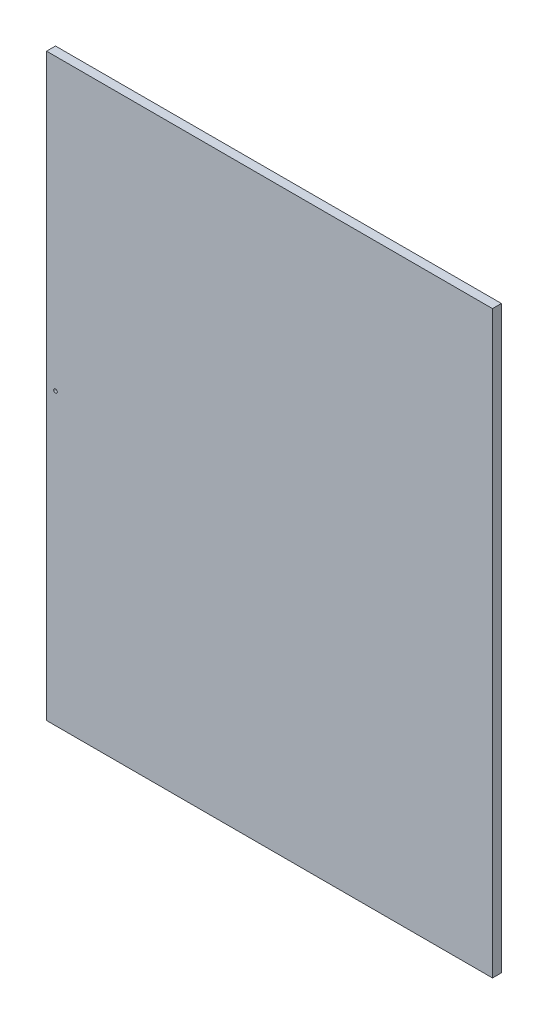
ISO-10303-21;
HEADER;
FILE_DESCRIPTION(('STEP AP214'),'2;1');
FILE_NAME('part.step','',(''),(''),'','','');
FILE_SCHEMA(('AUTOMOTIVE_DESIGN { 1 0 10303 214 1 1 1 1 }'));
ENDSEC;
DATA;
#1=APPLICATION_CONTEXT('core data for automotive mechanical design processes');
#2=APPLICATION_PROTOCOL_DEFINITION('international standard','automotive_design',2000,#1);
#3=PRODUCT_CONTEXT('',#1,'mechanical');
#4=PRODUCT('Part','Part','',(#3));
#5=PRODUCT_RELATED_PRODUCT_CATEGORY('part','',(#4));
#6=PRODUCT_DEFINITION_FORMATION('','',#4);
#7=PRODUCT_DEFINITION_CONTEXT('part definition',#1,'design');
#8=PRODUCT_DEFINITION('design','',#6,#7);
#9=PRODUCT_DEFINITION_SHAPE('','',#8);
#10=(LENGTH_UNIT() NAMED_UNIT(*) SI_UNIT(.MILLI.,.METRE.));
#11=(NAMED_UNIT(*) PLANE_ANGLE_UNIT() SI_UNIT($,.RADIAN.));
#12=(NAMED_UNIT(*) SI_UNIT($,.STERADIAN.) SOLID_ANGLE_UNIT());
#13=UNCERTAINTY_MEASURE_WITH_UNIT(LENGTH_MEASURE(1.E-05),#10,'distance_accuracy_value','');
#14=(GEOMETRIC_REPRESENTATION_CONTEXT(3) GLOBAL_UNCERTAINTY_ASSIGNED_CONTEXT((#13)) GLOBAL_UNIT_ASSIGNED_CONTEXT((#10,
#11,#12)) REPRESENTATION_CONTEXT('',''));
#15=CARTESIAN_POINT('',(0.,0.,0.));
#16=DIRECTION('',(0.,0.,1.));
#17=DIRECTION('',(1.,0.,0.));
#18=AXIS2_PLACEMENT_3D('',#15,#16,#17);
#19=CARTESIAN_POINT('',(0.,0.,10.));
#20=DIRECTION('',(0.,0.,-1.));
#21=DIRECTION('',(-1.,0.,0.));
#22=AXIS2_PLACEMENT_3D('',#19,#20,#21);
#23=PLANE('',#22);
#24=DIRECTION('',(1.,0.,0.));
#25=VECTOR('',#24,1.);
#26=CARTESIAN_POINT('',(500.,0.,10.));
#27=LINE('',#26,#25);
#28=CARTESIAN_POINT('',(0.,0.,10.));
#29=VERTEX_POINT('',#28);
#30=CARTESIAN_POINT('',(500.,0.,10.));
#31=VERTEX_POINT('',#30);
#32=EDGE_CURVE('E87',#29,#31,#27,.T.);
#33=ORIENTED_EDGE('',*,*,#32,.T.);
#34=DIRECTION('',(0.,1.,0.));
#35=VECTOR('',#34,1.);
#36=CARTESIAN_POINT('',(500.,650.,10.));
#37=LINE('',#36,#35);
#38=CARTESIAN_POINT('',(500.,650.,10.));
#39=VERTEX_POINT('',#38);
#40=EDGE_CURVE('E82',#31,#39,#37,.T.);
#41=ORIENTED_EDGE('',*,*,#40,.T.);
#42=DIRECTION('',(-1.,0.,0.));
#43=VECTOR('',#42,1.);
#44=CARTESIAN_POINT('',(0.,650.,10.));
#45=LINE('',#44,#43);
#46=CARTESIAN_POINT('',(0.,650.,10.));
#47=VERTEX_POINT('',#46);
#48=EDGE_CURVE('E85',#39,#47,#45,.T.);
#49=ORIENTED_EDGE('',*,*,#48,.T.);
#50=DIRECTION('',(0.,-1.,0.));
#51=VECTOR('',#50,1.);
#52=CARTESIAN_POINT('',(0.,0.,10.));
#53=LINE('',#52,#51);
#54=EDGE_CURVE('E52',#47,#29,#53,.T.);
#55=ORIENTED_EDGE('',*,*,#54,.T.);
#56=EDGE_LOOP('',(#33,#41,#49,#55));
#57=FACE_BOUND('',#56,.T.);
#58=CARTESIAN_POINT('',(10.,325.,10.));
#59=DIRECTION('',(0.,0.,1.));
#60=DIRECTION('',(1.,0.,0.));
#61=AXIS2_PLACEMENT_3D('',#58,#59,#60);
#62=CIRCLE('',#61,2.00000000000001);
#63=CARTESIAN_POINT('',(12.,325.,10.));
#64=VERTEX_POINT('',#63);
#65=EDGE_CURVE('E102',#64,#64,#62,.T.);
#66=ORIENTED_EDGE('',*,*,#65,.F.);
#67=EDGE_LOOP('',(#66));
#68=FACE_BOUND('',#67,.T.);
#69=ADVANCED_FACE('F35',(#57,#68),#23,.F.);
#70=CARTESIAN_POINT('',(0.,0.,0.));
#71=DIRECTION('',(0.,0.,-1.));
#72=DIRECTION('',(-1.,0.,0.));
#73=AXIS2_PLACEMENT_3D('',#70,#71,#72);
#74=PLANE('',#73);
#75=DIRECTION('',(1.,0.,0.));
#76=VECTOR('',#75,1.);
#77=CARTESIAN_POINT('',(500.,0.,0.));
#78=LINE('',#77,#76);
#79=CARTESIAN_POINT('',(0.,0.,0.));
#80=VERTEX_POINT('',#79);
#81=CARTESIAN_POINT('',(500.,0.,0.));
#82=VERTEX_POINT('',#81);
#83=EDGE_CURVE('E99',#80,#82,#78,.T.);
#84=ORIENTED_EDGE('',*,*,#83,.F.);
#85=DIRECTION('',(0.,-1.,0.));
#86=VECTOR('',#85,1.);
#87=CARTESIAN_POINT('',(0.,0.,0.));
#88=LINE('',#87,#86);
#89=CARTESIAN_POINT('',(0.,650.,0.));
#90=VERTEX_POINT('',#89);
#91=EDGE_CURVE('E75',#90,#80,#88,.T.);
#92=ORIENTED_EDGE('',*,*,#91,.F.);
#93=DIRECTION('',(-1.,0.,0.));
#94=VECTOR('',#93,1.);
#95=CARTESIAN_POINT('',(0.,650.,0.));
#96=LINE('',#95,#94);
#97=CARTESIAN_POINT('',(500.,650.,0.));
#98=VERTEX_POINT('',#97);
#99=EDGE_CURVE('E69',#98,#90,#96,.T.);
#100=ORIENTED_EDGE('',*,*,#99,.F.);
#101=DIRECTION('',(0.,1.,0.));
#102=VECTOR('',#101,1.);
#103=CARTESIAN_POINT('',(500.,650.,0.));
#104=LINE('',#103,#102);
#105=EDGE_CURVE('E91',#82,#98,#104,.T.);
#106=ORIENTED_EDGE('',*,*,#105,.F.);
#107=EDGE_LOOP('',(#84,#92,#100,#106));
#108=FACE_BOUND('',#107,.T.);
#109=CARTESIAN_POINT('',(10.,325.,0.));
#110=DIRECTION('',(0.,0.,1.));
#111=DIRECTION('',(1.,0.,0.));
#112=AXIS2_PLACEMENT_3D('',#109,#110,#111);
#113=CIRCLE('',#112,2.00000000000001);
#114=CARTESIAN_POINT('',(12.,325.,0.));
#115=VERTEX_POINT('',#114);
#116=EDGE_CURVE('E114',#115,#115,#113,.T.);
#117=ORIENTED_EDGE('',*,*,#116,.T.);
#118=EDGE_LOOP('',(#117));
#119=FACE_BOUND('',#118,.T.);
#120=ADVANCED_FACE('F110',(#108,#119),#74,.T.);
#121=CARTESIAN_POINT('',(500.,0.,10.));
#122=DIRECTION('',(0.,1.,0.));
#123=DIRECTION('',(0.,0.,1.));
#124=AXIS2_PLACEMENT_3D('',#121,#122,#123);
#125=PLANE('',#124);
#126=ORIENTED_EDGE('',*,*,#83,.T.);
#127=DIRECTION('',(0.,0.,-1.));
#128=VECTOR('',#127,1.);
#129=CARTESIAN_POINT('',(500.,0.,10.));
#130=LINE('',#129,#128);
#131=EDGE_CURVE('E11',#31,#82,#130,.T.);
#132=ORIENTED_EDGE('',*,*,#131,.F.);
#133=ORIENTED_EDGE('',*,*,#32,.F.);
#134=DIRECTION('',(0.,0.,-1.));
#135=VECTOR('',#134,1.);
#136=CARTESIAN_POINT('',(0.,0.,10.));
#137=LINE('',#136,#135);
#138=EDGE_CURVE('E95',#29,#80,#137,.T.);
#139=ORIENTED_EDGE('',*,*,#138,.T.);
#140=EDGE_LOOP('',(#126,#132,#133,#139));
#141=FACE_BOUND('',#140,.T.);
#142=ADVANCED_FACE('F37',(#141),#125,.F.);
#143=CARTESIAN_POINT('',(500.,650.,10.));
#144=DIRECTION('',(-1.,0.,0.));
#145=DIRECTION('',(0.,0.,1.));
#146=AXIS2_PLACEMENT_3D('',#143,#144,#145);
#147=PLANE('',#146);
#148=ORIENTED_EDGE('',*,*,#105,.T.);
#149=DIRECTION('',(0.,0.,-1.));
#150=VECTOR('',#149,1.);
#151=CARTESIAN_POINT('',(500.,650.,10.));
#152=LINE('',#151,#150);
#153=EDGE_CURVE('E44',#39,#98,#152,.T.);
#154=ORIENTED_EDGE('',*,*,#153,.F.);
#155=ORIENTED_EDGE('',*,*,#40,.F.);
#156=ORIENTED_EDGE('',*,*,#131,.T.);
#157=EDGE_LOOP('',(#148,#154,#155,#156));
#158=FACE_BOUND('',#157,.T.);
#159=ADVANCED_FACE('F90',(#158),#147,.F.);
#160=CARTESIAN_POINT('',(0.,650.,10.));
#161=DIRECTION('',(0.,-1.,0.));
#162=DIRECTION('',(0.,0.,-1.));
#163=AXIS2_PLACEMENT_3D('',#160,#161,#162);
#164=PLANE('',#163);
#165=ORIENTED_EDGE('',*,*,#99,.T.);
#166=DIRECTION('',(0.,0.,-1.));
#167=VECTOR('',#166,1.);
#168=CARTESIAN_POINT('',(0.,650.,10.));
#169=LINE('',#168,#167);
#170=EDGE_CURVE('E92',#47,#90,#169,.T.);
#171=ORIENTED_EDGE('',*,*,#170,.F.);
#172=ORIENTED_EDGE('',*,*,#48,.F.);
#173=ORIENTED_EDGE('',*,*,#153,.T.);
#174=EDGE_LOOP('',(#165,#171,#172,#173));
#175=FACE_BOUND('',#174,.T.);
#176=ADVANCED_FACE('F93',(#175),#164,.F.);
#177=CARTESIAN_POINT('',(0.,0.,10.));
#178=DIRECTION('',(1.,0.,0.));
#179=DIRECTION('',(0.,0.,-1.));
#180=AXIS2_PLACEMENT_3D('',#177,#178,#179);
#181=PLANE('',#180);
#182=ORIENTED_EDGE('',*,*,#91,.T.);
#183=ORIENTED_EDGE('',*,*,#138,.F.);
#184=ORIENTED_EDGE('',*,*,#54,.F.);
#185=ORIENTED_EDGE('',*,*,#170,.T.);
#186=EDGE_LOOP('',(#182,#183,#184,#185));
#187=FACE_BOUND('',#186,.T.);
#188=ADVANCED_FACE('F107',(#187),#181,.F.);
#189=CARTESIAN_POINT('',(10.,325.,10.));
#190=DIRECTION('',(0.,0.,-1.));
#191=DIRECTION('',(-1.,0.,0.));
#192=AXIS2_PLACEMENT_3D('',#189,#190,#191);
#193=CYLINDRICAL_SURFACE('',#192,2.00000000000001);
#194=ORIENTED_EDGE('',*,*,#65,.T.);
#195=EDGE_LOOP('',(#194));
#196=FACE_BOUND('',#195,.T.);
#197=ORIENTED_EDGE('',*,*,#116,.F.);
#198=EDGE_LOOP('',(#197));
#199=FACE_BOUND('',#198,.T.);
#200=ADVANCED_FACE('F120',(#196,#199),#193,.F.);
#201=CLOSED_SHELL('',(#69,#120,#142,#159,#176,#188,#200));
#202=MANIFOLD_SOLID_BREP('B2',#201);
#203=ADVANCED_BREP_SHAPE_REPRESENTATION('',(#18,#202),#14);
#204=SHAPE_DEFINITION_REPRESENTATION(#9,#203);
ENDSEC;
END-ISO-10303-21;
